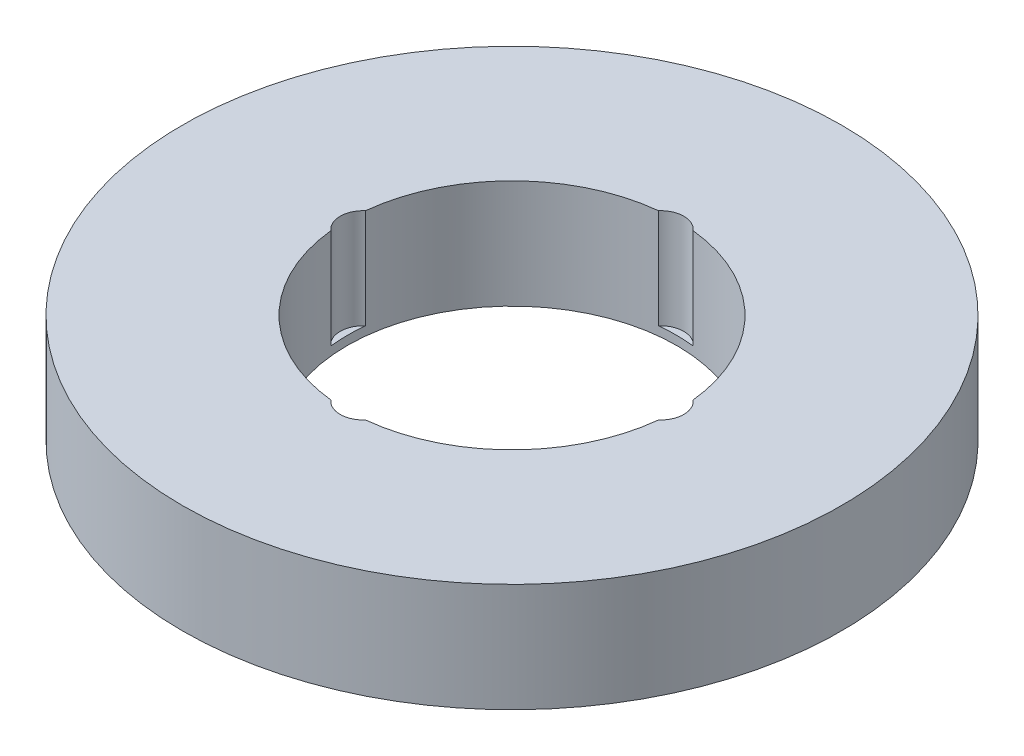
ISO-10303-21;
HEADER;
FILE_DESCRIPTION(('STEP AP214'),'2;1');
FILE_NAME('part.step','',(''),(''),'','','');
FILE_SCHEMA(('AUTOMOTIVE_DESIGN { 1 0 10303 214 1 1 1 1 }'));
ENDSEC;
DATA;
#1=APPLICATION_CONTEXT('core data for automotive mechanical design processes');
#2=APPLICATION_PROTOCOL_DEFINITION('international standard','automotive_design',2000,#1);
#3=PRODUCT_CONTEXT('',#1,'mechanical');
#4=PRODUCT('Part','Part','',(#3));
#5=PRODUCT_RELATED_PRODUCT_CATEGORY('part','',(#4));
#6=PRODUCT_DEFINITION_FORMATION('','',#4);
#7=PRODUCT_DEFINITION_CONTEXT('part definition',#1,'design');
#8=PRODUCT_DEFINITION('design','',#6,#7);
#9=PRODUCT_DEFINITION_SHAPE('','',#8);
#10=(LENGTH_UNIT() NAMED_UNIT(*) SI_UNIT(.MILLI.,.METRE.));
#11=(NAMED_UNIT(*) PLANE_ANGLE_UNIT() SI_UNIT($,.RADIAN.));
#12=(NAMED_UNIT(*) SI_UNIT($,.STERADIAN.) SOLID_ANGLE_UNIT());
#13=UNCERTAINTY_MEASURE_WITH_UNIT(LENGTH_MEASURE(1.E-05),#10,'distance_accuracy_value','');
#14=(GEOMETRIC_REPRESENTATION_CONTEXT(3) GLOBAL_UNCERTAINTY_ASSIGNED_CONTEXT((#13)) GLOBAL_UNIT_ASSIGNED_CONTEXT((#10,
#11,#12)) REPRESENTATION_CONTEXT('',''));
#15=CARTESIAN_POINT('',(0.,0.,0.));
#16=DIRECTION('',(0.,0.,1.));
#17=DIRECTION('',(1.,0.,0.));
#18=AXIS2_PLACEMENT_3D('',#15,#16,#17);
#19=CARTESIAN_POINT('',(0.,28.,0.));
#20=DIRECTION('',(0.,-1.,0.));
#21=DIRECTION('',(0.,0.,-1.));
#22=AXIS2_PLACEMENT_3D('',#19,#20,#21);
#23=CYLINDRICAL_SURFACE('',#22,85.);
#24=CARTESIAN_POINT('',(0.,28.,0.));
#25=DIRECTION('',(0.,1.,0.));
#26=DIRECTION('',(0.,0.,1.));
#27=AXIS2_PLACEMENT_3D('',#24,#25,#26);
#28=CIRCLE('',#27,85.);
#29=CARTESIAN_POINT('',(0.,28.,85.));
#30=VERTEX_POINT('',#29);
#31=EDGE_CURVE('E148',#30,#30,#28,.T.);
#32=ORIENTED_EDGE('',*,*,#31,.F.);
#33=EDGE_LOOP('',(#32));
#34=FACE_BOUND('',#33,.T.);
#35=CARTESIAN_POINT('',(0.,0.,0.));
#36=DIRECTION('',(0.,1.,0.));
#37=DIRECTION('',(0.,0.,1.));
#38=AXIS2_PLACEMENT_3D('',#35,#36,#37);
#39=CIRCLE('',#38,85.);
#40=CARTESIAN_POINT('',(0.,0.,85.));
#41=VERTEX_POINT('',#40);
#42=EDGE_CURVE('E139',#41,#41,#39,.T.);
#43=ORIENTED_EDGE('',*,*,#42,.T.);
#44=EDGE_LOOP('',(#43));
#45=FACE_BOUND('',#44,.T.);
#46=ADVANCED_FACE('F39',(#34,#45),#23,.T.);
#47=CARTESIAN_POINT('',(0.,28.,0.));
#48=DIRECTION('',(0.,1.,0.));
#49=DIRECTION('',(0.,0.,1.));
#50=AXIS2_PLACEMENT_3D('',#47,#48,#49);
#51=PLANE('',#50);
#52=CARTESIAN_POINT('',(1.33940068267147E-13,28.,38.3619602307617));
#53=DIRECTION('',(0.,1.,0.));
#54=DIRECTION('',(1.,0.,0.));
#55=AXIS2_PLACEMENT_3D('',#52,#53,#54);
#56=CIRCLE('',#55,5.93712615035879);
#57=CARTESIAN_POINT('',(-4.47498719505919,28.,42.2637491191217));
#58=VERTEX_POINT('',#57);
#59=CARTESIAN_POINT('',(4.47498719505948,28.,42.2637491191216));
#60=VERTEX_POINT('',#59);
#61=EDGE_CURVE('E175',#58,#60,#56,.T.);
#62=ORIENTED_EDGE('',*,*,#61,.F.);
#63=CARTESIAN_POINT('',(0.,28.,0.));
#64=DIRECTION('',(0.,1.,0.));
#65=DIRECTION('',(0.,0.,1.));
#66=AXIS2_PLACEMENT_3D('',#63,#64,#65);
#67=CIRCLE('',#66,42.5);
#68=CARTESIAN_POINT('',(-42.2637491191216,28.,4.47498719505934));
#69=VERTEX_POINT('',#68);
#70=EDGE_CURVE('E134',#69,#58,#67,.T.);
#71=ORIENTED_EDGE('',*,*,#70,.F.);
#72=CARTESIAN_POINT('',(-38.3619602307617,28.,0.));
#73=DIRECTION('',(0.,1.,0.));
#74=DIRECTION('',(0.,0.,1.));
#75=AXIS2_PLACEMENT_3D('',#72,#73,#74);
#76=CIRCLE('',#75,5.93712615035879);
#77=CARTESIAN_POINT('',(-42.2637491191216,28.,-4.47498719505934));
#78=VERTEX_POINT('',#77);
#79=EDGE_CURVE('E143',#78,#69,#76,.T.);
#80=ORIENTED_EDGE('',*,*,#79,.F.);
#81=CARTESIAN_POINT('',(-4.47498719505978,28.,-42.2637491191216));
#82=VERTEX_POINT('',#81);
#83=EDGE_CURVE('E123',#82,#78,#67,.T.);
#84=ORIENTED_EDGE('',*,*,#83,.F.);
#85=CARTESIAN_POINT('',(-4.01820204801441E-13,28.,-38.3619602307617));
#86=DIRECTION('',(0.,1.,0.));
#87=DIRECTION('',(-1.,0.,0.));
#88=AXIS2_PLACEMENT_3D('',#85,#86,#87);
#89=CIRCLE('',#88,5.93712615035879);
#90=CARTESIAN_POINT('',(4.47498719505889,28.,-42.2637491191217));
#91=VERTEX_POINT('',#90);
#92=EDGE_CURVE('E106',#91,#82,#89,.T.);
#93=ORIENTED_EDGE('',*,*,#92,.F.);
#94=CARTESIAN_POINT('',(42.2637491191216,28.,-4.47498719505934));
#95=VERTEX_POINT('',#94);
#96=EDGE_CURVE('E125',#95,#91,#67,.T.);
#97=ORIENTED_EDGE('',*,*,#96,.F.);
#98=CARTESIAN_POINT('',(38.3619602307617,28.,0.));
#99=DIRECTION('',(0.,1.,0.));
#100=DIRECTION('',(0.,0.,-1.));
#101=AXIS2_PLACEMENT_3D('',#98,#99,#100);
#102=CIRCLE('',#101,5.93712615035879);
#103=CARTESIAN_POINT('',(42.2637491191216,28.,4.47498719505934));
#104=VERTEX_POINT('',#103);
#105=EDGE_CURVE('E286',#104,#95,#102,.T.);
#106=ORIENTED_EDGE('',*,*,#105,.F.);
#107=EDGE_CURVE('E135',#60,#104,#67,.T.);
#108=ORIENTED_EDGE('',*,*,#107,.F.);
#109=EDGE_LOOP('',(#62,#71,#80,#84,#93,#97,#106,#108));
#110=FACE_BOUND('',#109,.T.);
#111=ORIENTED_EDGE('',*,*,#31,.T.);
#112=EDGE_LOOP('',(#111));
#113=FACE_BOUND('',#112,.T.);
#114=ADVANCED_FACE('F118',(#110,#113),#51,.T.);
#115=CARTESIAN_POINT('',(0.,0.,0.));
#116=DIRECTION('',(0.,1.,0.));
#117=DIRECTION('',(0.,0.,1.));
#118=AXIS2_PLACEMENT_3D('',#115,#116,#117);
#119=PLANE('',#118);
#120=CARTESIAN_POINT('',(0.,0.,0.));
#121=DIRECTION('',(0.,1.,0.));
#122=DIRECTION('',(0.,0.,1.));
#123=AXIS2_PLACEMENT_3D('',#120,#121,#122);
#124=CIRCLE('',#123,42.5);
#125=CARTESIAN_POINT('',(0.,0.,42.5));
#126=VERTEX_POINT('',#125);
#127=EDGE_CURVE('E136',#126,#126,#124,.T.);
#128=ORIENTED_EDGE('',*,*,#127,.T.);
#129=EDGE_LOOP('',(#128));
#130=FACE_BOUND('',#129,.T.);
#131=ORIENTED_EDGE('',*,*,#42,.F.);
#132=EDGE_LOOP('',(#131));
#133=FACE_BOUND('',#132,.T.);
#134=ADVANCED_FACE('F187',(#130,#133),#119,.F.);
#135=CARTESIAN_POINT('',(0.,28.,0.));
#136=DIRECTION('',(0.,-1.,0.));
#137=DIRECTION('',(0.,0.,-1.));
#138=AXIS2_PLACEMENT_3D('',#135,#136,#137);
#139=CYLINDRICAL_SURFACE('',#138,42.5);
#140=DIRECTION('',(0.,1.,0.));
#141=VECTOR('',#140,1.);
#142=CARTESIAN_POINT('',(-4.47498719505919,15.1387293517664,42.2637491191217));
#143=LINE('',#142,#141);
#144=CARTESIAN_POINT('',(-4.47498719505919,2.2774587035328,42.2637491191217));
#145=VERTEX_POINT('',#144);
#146=EDGE_CURVE('E11',#145,#58,#143,.T.);
#147=ORIENTED_EDGE('',*,*,#146,.F.);
#148=CARTESIAN_POINT('',(0.,2.2774587035328,0.));
#149=DIRECTION('',(0.,1.,0.));
#150=DIRECTION('',(0.,0.,1.));
#151=AXIS2_PLACEMENT_3D('',#148,#149,#150);
#152=CIRCLE('',#151,42.5);
#153=CARTESIAN_POINT('',(4.47498719505948,2.2774587035328,42.2637491191216));
#154=VERTEX_POINT('',#153);
#155=EDGE_CURVE('E170',#145,#154,#152,.T.);
#156=ORIENTED_EDGE('',*,*,#155,.T.);
#157=DIRECTION('',(0.,1.,0.));
#158=VECTOR('',#157,1.);
#159=CARTESIAN_POINT('',(4.47498719505948,15.1387293517664,42.2637491191216));
#160=LINE('',#159,#158);
#161=EDGE_CURVE('E46',#60,#154,#160,.F.);
#162=ORIENTED_EDGE('',*,*,#161,.F.);
#163=ORIENTED_EDGE('',*,*,#107,.T.);
#164=DIRECTION('',(0.,1.,0.));
#165=VECTOR('',#164,1.);
#166=CARTESIAN_POINT('',(42.2637491191216,15.1387293517664,4.47498719505934));
#167=LINE('',#166,#165);
#168=CARTESIAN_POINT('',(42.2637491191216,2.2774587035328,4.47498719505934));
#169=VERTEX_POINT('',#168);
#170=EDGE_CURVE('E164',#169,#104,#167,.T.);
#171=ORIENTED_EDGE('',*,*,#170,.F.);
#172=CARTESIAN_POINT('',(0.,2.2774587035328,0.));
#173=DIRECTION('',(0.,1.,0.));
#174=DIRECTION('',(0.,0.,1.));
#175=AXIS2_PLACEMENT_3D('',#172,#173,#174);
#176=CIRCLE('',#175,42.5);
#177=CARTESIAN_POINT('',(42.2637491191216,2.2774587035328,-4.47498719505934));
#178=VERTEX_POINT('',#177);
#179=EDGE_CURVE('E115',#169,#178,#176,.T.);
#180=ORIENTED_EDGE('',*,*,#179,.T.);
#181=DIRECTION('',(0.,1.,0.));
#182=VECTOR('',#181,1.);
#183=CARTESIAN_POINT('',(42.2637491191216,15.1387293517664,-4.47498719505934));
#184=LINE('',#183,#182);
#185=EDGE_CURVE('E131',#95,#178,#184,.F.);
#186=ORIENTED_EDGE('',*,*,#185,.F.);
#187=ORIENTED_EDGE('',*,*,#96,.T.);
#188=DIRECTION('',(0.,1.,0.));
#189=VECTOR('',#188,1.);
#190=CARTESIAN_POINT('',(4.47498719505889,15.1387293517664,-42.2637491191217));
#191=LINE('',#190,#189);
#192=CARTESIAN_POINT('',(4.47498719505889,2.2774587035328,-42.2637491191217));
#193=VERTEX_POINT('',#192);
#194=EDGE_CURVE('E105',#193,#91,#191,.T.);
#195=ORIENTED_EDGE('',*,*,#194,.F.);
#196=CARTESIAN_POINT('',(0.,2.2774587035328,0.));
#197=DIRECTION('',(0.,1.,0.));
#198=DIRECTION('',(0.,0.,1.));
#199=AXIS2_PLACEMENT_3D('',#196,#197,#198);
#200=CIRCLE('',#199,42.5);
#201=CARTESIAN_POINT('',(-4.47498719505978,2.2774587035328,-42.2637491191216));
#202=VERTEX_POINT('',#201);
#203=EDGE_CURVE('E159',#193,#202,#200,.T.);
#204=ORIENTED_EDGE('',*,*,#203,.T.);
#205=DIRECTION('',(0.,1.,0.));
#206=VECTOR('',#205,1.);
#207=CARTESIAN_POINT('',(-4.47498719505978,15.1387293517664,-42.2637491191216));
#208=LINE('',#207,#206);
#209=EDGE_CURVE('E114',#82,#202,#208,.F.);
#210=ORIENTED_EDGE('',*,*,#209,.F.);
#211=ORIENTED_EDGE('',*,*,#83,.T.);
#212=DIRECTION('',(0.,1.,0.));
#213=VECTOR('',#212,1.);
#214=CARTESIAN_POINT('',(-42.2637491191216,15.1387293517664,-4.47498719505934));
#215=LINE('',#214,#213);
#216=CARTESIAN_POINT('',(-42.2637491191216,2.2774587035328,-4.47498719505934));
#217=VERTEX_POINT('',#216);
#218=EDGE_CURVE('E160',#217,#78,#215,.T.);
#219=ORIENTED_EDGE('',*,*,#218,.F.);
#220=CARTESIAN_POINT('',(0.,2.2774587035328,0.));
#221=DIRECTION('',(0.,1.,0.));
#222=DIRECTION('',(0.,0.,1.));
#223=AXIS2_PLACEMENT_3D('',#220,#221,#222);
#224=CIRCLE('',#223,42.5);
#225=CARTESIAN_POINT('',(-42.2637491191216,2.2774587035328,4.47498719505934));
#226=VERTEX_POINT('',#225);
#227=EDGE_CURVE('E149',#217,#226,#224,.T.);
#228=ORIENTED_EDGE('',*,*,#227,.T.);
#229=DIRECTION('',(0.,1.,0.));
#230=VECTOR('',#229,1.);
#231=CARTESIAN_POINT('',(-42.2637491191216,15.1387293517664,4.47498719505934));
#232=LINE('',#231,#230);
#233=EDGE_CURVE('E152',#69,#226,#232,.F.);
#234=ORIENTED_EDGE('',*,*,#233,.F.);
#235=ORIENTED_EDGE('',*,*,#70,.T.);
#236=EDGE_LOOP('',(#147,#156,#162,#163,#171,#180,#186,#187,#195,#204,#210,#211,#219,#228,#234,#235));
#237=FACE_BOUND('',#236,.T.);
#238=ORIENTED_EDGE('',*,*,#127,.F.);
#239=EDGE_LOOP('',(#238));
#240=FACE_BOUND('',#239,.T.);
#241=ADVANCED_FACE('F126',(#237,#240),#139,.F.);
#242=CARTESIAN_POINT('',(-38.3619602307617,2.2774587035328,0.));
#243=DIRECTION('',(0.,1.,0.));
#244=DIRECTION('',(0.,0.,1.));
#245=AXIS2_PLACEMENT_3D('',#242,#243,#244);
#246=CYLINDRICAL_SURFACE('',#245,5.93712615035879);
#247=ORIENTED_EDGE('',*,*,#218,.T.);
#248=ORIENTED_EDGE('',*,*,#79,.T.);
#249=ORIENTED_EDGE('',*,*,#233,.T.);
#250=CARTESIAN_POINT('',(-38.3619602307617,2.2774587035328,0.));
#251=DIRECTION('',(0.,1.,0.));
#252=DIRECTION('',(0.,0.,1.));
#253=AXIS2_PLACEMENT_3D('',#250,#251,#252);
#254=CIRCLE('',#253,5.93712615035879);
#255=EDGE_CURVE('E144',#217,#226,#254,.T.);
#256=ORIENTED_EDGE('',*,*,#255,.F.);
#257=EDGE_LOOP('',(#247,#248,#249,#256));
#258=FACE_BOUND('',#257,.T.);
#259=ADVANCED_FACE('F200',(#258),#246,.F.);
#260=CARTESIAN_POINT('',(-38.3619602307617,2.2774587035328,0.));
#261=DIRECTION('',(0.,1.,0.));
#262=DIRECTION('',(0.,0.,1.));
#263=AXIS2_PLACEMENT_3D('',#260,#261,#262);
#264=PLANE('',#263);
#265=ORIENTED_EDGE('',*,*,#255,.T.);
#266=ORIENTED_EDGE('',*,*,#227,.F.);
#267=EDGE_LOOP('',(#265,#266));
#268=FACE_BOUND('',#267,.T.);
#269=ADVANCED_FACE('F201',(#268),#264,.T.);
#270=CARTESIAN_POINT('',(-4.01820204801441E-13,2.2774587035328,-38.3619602307617));
#271=DIRECTION('',(0.,1.,0.));
#272=DIRECTION('',(0.,0.,1.));
#273=AXIS2_PLACEMENT_3D('',#270,#271,#272);
#274=CYLINDRICAL_SURFACE('',#273,5.93712615035879);
#275=ORIENTED_EDGE('',*,*,#194,.T.);
#276=ORIENTED_EDGE('',*,*,#92,.T.);
#277=ORIENTED_EDGE('',*,*,#209,.T.);
#278=CARTESIAN_POINT('',(-4.01820204801441E-13,2.2774587035328,-38.3619602307617));
#279=DIRECTION('',(0.,1.,0.));
#280=DIRECTION('',(-1.,0.,0.));
#281=AXIS2_PLACEMENT_3D('',#278,#279,#280);
#282=CIRCLE('',#281,5.93712615035879);
#283=EDGE_CURVE('E107',#193,#202,#282,.T.);
#284=ORIENTED_EDGE('',*,*,#283,.F.);
#285=EDGE_LOOP('',(#275,#276,#277,#284));
#286=FACE_BOUND('',#285,.T.);
#287=ADVANCED_FACE('F102',(#286),#274,.F.);
#288=CARTESIAN_POINT('',(-4.01820204801441E-13,2.2774587035328,-38.3619602307617));
#289=DIRECTION('',(0.,1.,0.));
#290=DIRECTION('',(-1.,0.,0.));
#291=AXIS2_PLACEMENT_3D('',#288,#289,#290);
#292=PLANE('',#291);
#293=ORIENTED_EDGE('',*,*,#283,.T.);
#294=ORIENTED_EDGE('',*,*,#203,.F.);
#295=EDGE_LOOP('',(#293,#294));
#296=FACE_BOUND('',#295,.T.);
#297=ADVANCED_FACE('F209',(#296),#292,.T.);
#298=CARTESIAN_POINT('',(38.3619602307617,2.2774587035328,0.));
#299=DIRECTION('',(0.,1.,0.));
#300=DIRECTION('',(0.,0.,1.));
#301=AXIS2_PLACEMENT_3D('',#298,#299,#300);
#302=CYLINDRICAL_SURFACE('',#301,5.93712615035879);
#303=ORIENTED_EDGE('',*,*,#170,.T.);
#304=ORIENTED_EDGE('',*,*,#105,.T.);
#305=ORIENTED_EDGE('',*,*,#185,.T.);
#306=CARTESIAN_POINT('',(38.3619602307617,2.2774587035328,0.));
#307=DIRECTION('',(0.,1.,0.));
#308=DIRECTION('',(0.,0.,-1.));
#309=AXIS2_PLACEMENT_3D('',#306,#307,#308);
#310=CIRCLE('',#309,5.93712615035879);
#311=EDGE_CURVE('E56',#169,#178,#310,.T.);
#312=ORIENTED_EDGE('',*,*,#311,.F.);
#313=EDGE_LOOP('',(#303,#304,#305,#312));
#314=FACE_BOUND('',#313,.T.);
#315=ADVANCED_FACE('F213',(#314),#302,.F.);
#316=CARTESIAN_POINT('',(38.3619602307617,2.2774587035328,0.));
#317=DIRECTION('',(0.,1.,0.));
#318=DIRECTION('',(0.,0.,-1.));
#319=AXIS2_PLACEMENT_3D('',#316,#317,#318);
#320=PLANE('',#319);
#321=ORIENTED_EDGE('',*,*,#311,.T.);
#322=ORIENTED_EDGE('',*,*,#179,.F.);
#323=EDGE_LOOP('',(#321,#322));
#324=FACE_BOUND('',#323,.T.);
#325=ADVANCED_FACE('F179',(#324),#320,.T.);
#326=CARTESIAN_POINT('',(1.33940068267147E-13,2.2774587035328,38.3619602307617));
#327=DIRECTION('',(0.,1.,0.));
#328=DIRECTION('',(0.,0.,1.));
#329=AXIS2_PLACEMENT_3D('',#326,#327,#328);
#330=CYLINDRICAL_SURFACE('',#329,5.93712615035879);
#331=ORIENTED_EDGE('',*,*,#146,.T.);
#332=ORIENTED_EDGE('',*,*,#61,.T.);
#333=ORIENTED_EDGE('',*,*,#161,.T.);
#334=CARTESIAN_POINT('',(1.33940068267147E-13,2.2774587035328,38.3619602307617));
#335=DIRECTION('',(0.,1.,0.));
#336=DIRECTION('',(1.,0.,0.));
#337=AXIS2_PLACEMENT_3D('',#334,#335,#336);
#338=CIRCLE('',#337,5.93712615035879);
#339=EDGE_CURVE('E55',#145,#154,#338,.T.);
#340=ORIENTED_EDGE('',*,*,#339,.F.);
#341=EDGE_LOOP('',(#331,#332,#333,#340));
#342=FACE_BOUND('',#341,.T.);
#343=ADVANCED_FACE('F171',(#342),#330,.F.);
#344=CARTESIAN_POINT('',(1.33940068267147E-13,2.2774587035328,38.3619602307617));
#345=DIRECTION('',(0.,1.,0.));
#346=DIRECTION('',(1.,0.,0.));
#347=AXIS2_PLACEMENT_3D('',#344,#345,#346);
#348=PLANE('',#347);
#349=ORIENTED_EDGE('',*,*,#339,.T.);
#350=ORIENTED_EDGE('',*,*,#155,.F.);
#351=EDGE_LOOP('',(#349,#350));
#352=FACE_BOUND('',#351,.T.);
#353=ADVANCED_FACE('F173',(#352),#348,.T.);
#354=CLOSED_SHELL('',(#46,#114,#134,#241,#259,#269,#287,#297,#315,#325,#343,#353));
#355=MANIFOLD_SOLID_BREP('B2',#354);
#356=ADVANCED_BREP_SHAPE_REPRESENTATION('',(#18,#355),#14);
#357=SHAPE_DEFINITION_REPRESENTATION(#9,#356);
ENDSEC;
END-ISO-10303-21;
